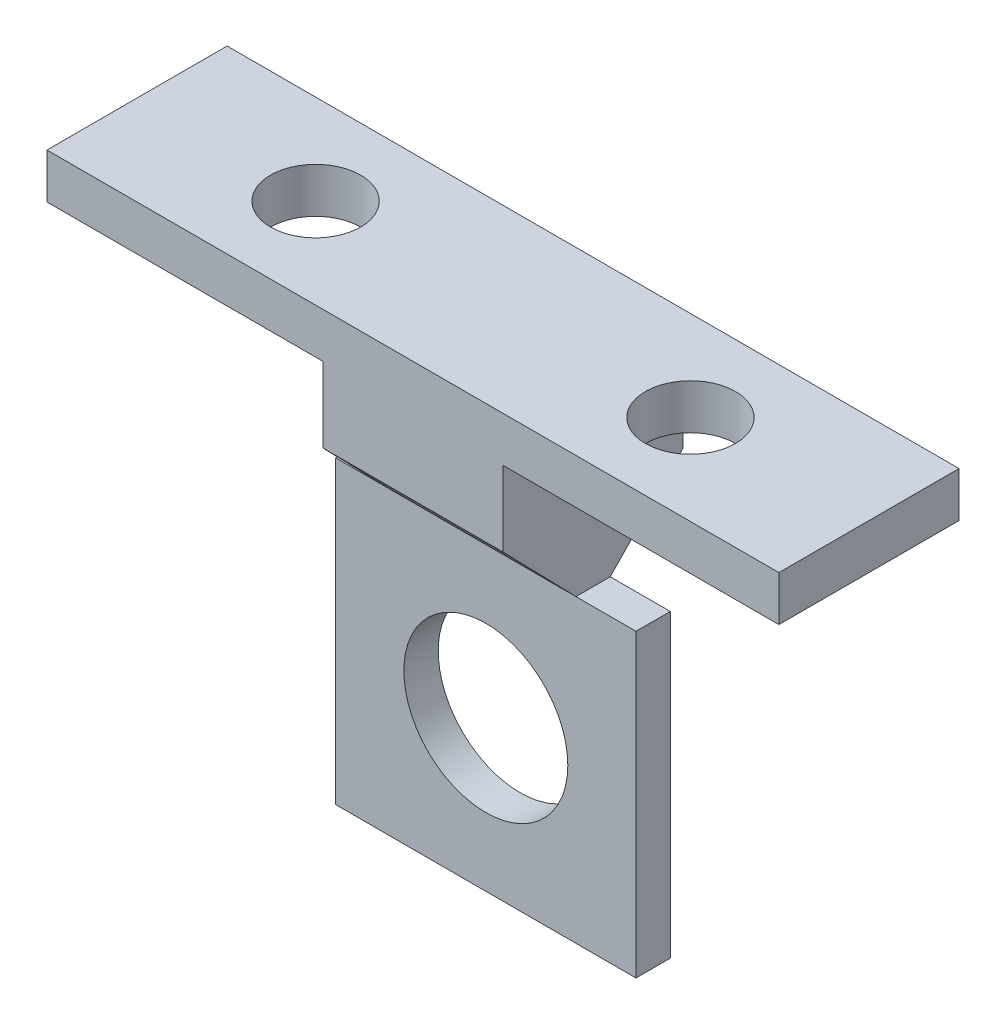
ISO-10303-21;
HEADER;
FILE_DESCRIPTION(('STEP AP214'),'2;1');
FILE_NAME('part.step','',(''),(''),'','','');
FILE_SCHEMA(('AUTOMOTIVE_DESIGN { 1 0 10303 214 1 1 1 1 }'));
ENDSEC;
DATA;
#1=APPLICATION_CONTEXT('core data for automotive mechanical design processes');
#2=APPLICATION_PROTOCOL_DEFINITION('international standard','automotive_design',2000,#1);
#3=PRODUCT_CONTEXT('',#1,'mechanical');
#4=PRODUCT('Part','Part','',(#3));
#5=PRODUCT_RELATED_PRODUCT_CATEGORY('part','',(#4));
#6=PRODUCT_DEFINITION_FORMATION('','',#4);
#7=PRODUCT_DEFINITION_CONTEXT('part definition',#1,'design');
#8=PRODUCT_DEFINITION('design','',#6,#7);
#9=PRODUCT_DEFINITION_SHAPE('','',#8);
#10=(LENGTH_UNIT() NAMED_UNIT(*) SI_UNIT(.MILLI.,.METRE.));
#11=(NAMED_UNIT(*) PLANE_ANGLE_UNIT() SI_UNIT($,.RADIAN.));
#12=(NAMED_UNIT(*) SI_UNIT($,.STERADIAN.) SOLID_ANGLE_UNIT());
#13=UNCERTAINTY_MEASURE_WITH_UNIT(LENGTH_MEASURE(1.E-05),#10,'distance_accuracy_value','');
#14=(GEOMETRIC_REPRESENTATION_CONTEXT(3) GLOBAL_UNCERTAINTY_ASSIGNED_CONTEXT((#13)) GLOBAL_UNIT_ASSIGNED_CONTEXT((#10,
#11,#12)) REPRESENTATION_CONTEXT('',''));
#15=CARTESIAN_POINT('',(0.,0.,0.));
#16=DIRECTION('',(0.,0.,1.));
#17=DIRECTION('',(1.,0.,0.));
#18=AXIS2_PLACEMENT_3D('',#15,#16,#17);
#19=CARTESIAN_POINT('',(-33.0408964823714,13.4768329024308,2.286));
#20=DIRECTION('',(0.,1.,0.));
#21=DIRECTION('',(0.,0.,1.));
#22=AXIS2_PLACEMENT_3D('',#19,#20,#21);
#23=PLANE('',#22);
#24=CARTESIAN_POINT('',(-26.5580724223715,13.4768329024308,1.143));
#25=DIRECTION('',(0.,1.,0.));
#26=DIRECTION('',(0.,0.,1.));
#27=AXIS2_PLACEMENT_3D('',#24,#25,#26);
#28=CIRCLE('',#27,2.99999999999999);
#29=CARTESIAN_POINT('',(-26.5580724223715,13.4768329024308,4.14299999999999));
#30=VERTEX_POINT('',#29);
#31=EDGE_CURVE('E302',#30,#30,#28,.F.);
#32=ORIENTED_EDGE('',*,*,#31,.F.);
#33=EDGE_LOOP('',(#32));
#34=FACE_BOUND('',#33,.T.);
#35=DIRECTION('',(0.,0.,-1.));
#36=VECTOR('',#35,1.);
#37=CARTESIAN_POINT('',(-33.0408964823714,13.4768329024308,2.286));
#38=LINE('',#37,#36);
#39=CARTESIAN_POINT('',(-33.0408964823714,13.4768329024311,7.143));
#40=VERTEX_POINT('',#39);
#41=CARTESIAN_POINT('',(-33.0408964823714,13.4768329024311,-4.857));
#42=VERTEX_POINT('',#41);
#43=EDGE_CURVE('E60',#40,#42,#38,.T.);
#44=ORIENTED_EDGE('',*,*,#43,.T.);
#45=DIRECTION('',(-1.,0.,0.));
#46=VECTOR('',#45,1.);
#47=CARTESIAN_POINT('',(-2.29721093551843,13.4768329024311,-4.857));
#48=LINE('',#47,#46);
#49=CARTESIAN_POINT('',(-14.6665278123714,13.4768329024311,-4.857));
#50=VERTEX_POINT('',#49);
#51=EDGE_CURVE('E202',#50,#42,#48,.T.);
#52=ORIENTED_EDGE('',*,*,#51,.F.);
#53=DIRECTION('',(0.,0.,-1.));
#54=VECTOR('',#53,1.);
#55=CARTESIAN_POINT('',(-14.6665278123714,13.4768329024308,2.286));
#56=LINE('',#55,#54);
#57=CARTESIAN_POINT('',(-14.6665278123714,13.4768329024311,7.143));
#58=VERTEX_POINT('',#57);
#59=EDGE_CURVE('E229',#58,#50,#56,.T.);
#60=ORIENTED_EDGE('',*,*,#59,.F.);
#61=DIRECTION('',(-1.,0.,0.));
#62=VECTOR('',#61,1.);
#63=CARTESIAN_POINT('',(-2.29721093551843,13.4768329024311,7.143));
#64=LINE('',#63,#62);
#65=EDGE_CURVE('E199',#58,#40,#64,.T.);
#66=ORIENTED_EDGE('',*,*,#65,.T.);
#67=EDGE_LOOP('',(#44,#52,#60,#66));
#68=FACE_BOUND('',#67,.T.);
#69=ADVANCED_FACE('F37',(#34,#68),#23,.F.);
#70=CARTESIAN_POINT('',(-51.5237205423715,13.4768329024308,1.143));
#71=DIRECTION('',(0.,1.,0.));
#72=DIRECTION('',(0.,0.,1.));
#73=AXIS2_PLACEMENT_3D('',#70,#71,#72);
#74=CIRCLE('',#73,3.);
#75=CARTESIAN_POINT('',(-51.5237205423715,13.4768329024308,4.143));
#76=VERTEX_POINT('',#75);
#77=EDGE_CURVE('E307',#76,#76,#74,.F.);
#78=ORIENTED_EDGE('',*,*,#77,.F.);
#79=EDGE_LOOP('',(#78));
#80=FACE_BOUND('',#79,.T.);
#81=DIRECTION('',(0.,0.,-1.));
#82=VECTOR('',#81,1.);
#83=CARTESIAN_POINT('',(-45.0408964823714,13.4768329024308,2.286));
#84=LINE('',#83,#82);
#85=CARTESIAN_POINT('',(-45.0408964823714,13.4768329024311,7.143));
#86=VERTEX_POINT('',#85);
#87=CARTESIAN_POINT('',(-45.0408964823714,13.4768329024311,-4.857));
#88=VERTEX_POINT('',#87);
#89=EDGE_CURVE('E46',#86,#88,#84,.T.);
#90=ORIENTED_EDGE('',*,*,#89,.F.);
#91=CARTESIAN_POINT('',(-63.4152651523715,13.4768329024311,7.143));
#92=VERTEX_POINT('',#91);
#93=EDGE_CURVE('E201',#86,#92,#64,.T.);
#94=ORIENTED_EDGE('',*,*,#93,.T.);
#95=DIRECTION('',(0.,0.,-1.));
#96=VECTOR('',#95,1.);
#97=CARTESIAN_POINT('',(-63.4152651523715,13.4768329024308,2.286));
#98=LINE('',#97,#96);
#99=CARTESIAN_POINT('',(-63.4152651523715,13.4768329024311,-4.857));
#100=VERTEX_POINT('',#99);
#101=EDGE_CURVE('E11',#92,#100,#98,.T.);
#102=ORIENTED_EDGE('',*,*,#101,.T.);
#103=EDGE_CURVE('E193',#88,#100,#48,.T.);
#104=ORIENTED_EDGE('',*,*,#103,.F.);
#105=EDGE_LOOP('',(#90,#94,#102,#104));
#106=FACE_BOUND('',#105,.T.);
#107=ADVANCED_FACE('F338',(#80,#106),#23,.F.);
#108=CARTESIAN_POINT('',(-63.4152651523714,16.4768329024308,2.286));
#109=DIRECTION('',(1.,0.,0.));
#110=DIRECTION('',(0.,1.,0.));
#111=AXIS2_PLACEMENT_3D('',#108,#109,#110);
#112=PLANE('',#111);
#113=DIRECTION('',(0.,0.,-1.));
#114=VECTOR('',#113,1.);
#115=CARTESIAN_POINT('',(-63.4152651523714,16.4768329024308,2.286));
#116=LINE('',#115,#114);
#117=CARTESIAN_POINT('',(-63.4152651523715,16.4768329024311,7.143));
#118=VERTEX_POINT('',#117);
#119=CARTESIAN_POINT('',(-63.4152651523715,16.4768329024311,-4.857));
#120=VERTEX_POINT('',#119);
#121=EDGE_CURVE('E216',#118,#120,#116,.T.);
#122=ORIENTED_EDGE('',*,*,#121,.T.);
#123=DIRECTION('',(0.,-1.,0.));
#124=VECTOR('',#123,1.);
#125=CARTESIAN_POINT('',(-63.4152651523715,16.4768329024311,-4.857));
#126=LINE('',#125,#124);
#127=EDGE_CURVE('E179',#120,#100,#126,.T.);
#128=ORIENTED_EDGE('',*,*,#127,.T.);
#129=ORIENTED_EDGE('',*,*,#101,.F.);
#130=DIRECTION('',(0.,1.,0.));
#131=VECTOR('',#130,1.);
#132=CARTESIAN_POINT('',(-63.4152651523715,16.4768329024311,7.143));
#133=LINE('',#132,#131);
#134=EDGE_CURVE('E190',#92,#118,#133,.T.);
#135=ORIENTED_EDGE('',*,*,#134,.T.);
#136=EDGE_LOOP('',(#122,#128,#129,#135));
#137=FACE_BOUND('',#136,.T.);
#138=ADVANCED_FACE('F39',(#137),#112,.F.);
#139=CARTESIAN_POINT('',(-45.0408964823714,8.47683290243078,2.286));
#140=DIRECTION('',(1.,0.,0.));
#141=DIRECTION('',(0.,0.,-1.));
#142=AXIS2_PLACEMENT_3D('',#139,#140,#141);
#143=PLANE('',#142);
#144=ORIENTED_EDGE('',*,*,#89,.T.);
#145=DIRECTION('',(0.,-1.,0.));
#146=VECTOR('',#145,1.);
#147=CARTESIAN_POINT('',(-45.0408964823714,13.4768329024311,-4.857));
#148=LINE('',#147,#146);
#149=CARTESIAN_POINT('',(-45.0408964823714,8.47683290243107,-4.857));
#150=VERTEX_POINT('',#149);
#151=EDGE_CURVE('E165',#88,#150,#148,.T.);
#152=ORIENTED_EDGE('',*,*,#151,.T.);
#153=DIRECTION('',(0.,-0.71728962347272,0.696775140241358));
#154=VECTOR('',#153,1.);
#155=CARTESIAN_POINT('',(-45.0408964823714,8.47683290243107,-4.857));
#156=LINE('',#155,#154);
#157=CARTESIAN_POINT('',(-45.0408964823714,3.47683290243076,0.));
#158=VERTEX_POINT('',#157);
#159=EDGE_CURVE('E297',#150,#158,#156,.T.);
#160=ORIENTED_EDGE('',*,*,#159,.T.);
#161=DIRECTION('',(0.,0.,-1.));
#162=VECTOR('',#161,1.);
#163=CARTESIAN_POINT('',(-45.0408964823714,3.47683290243078,2.286));
#164=LINE('',#163,#162);
#165=CARTESIAN_POINT('',(-45.0408964823714,3.47683290243078,2.286));
#166=VERTEX_POINT('',#165);
#167=EDGE_CURVE('E246',#166,#158,#164,.T.);
#168=ORIENTED_EDGE('',*,*,#167,.F.);
#169=DIRECTION('',(0.,0.71728962347272,0.696775140241358));
#170=VECTOR('',#169,1.);
#171=CARTESIAN_POINT('',(-45.0408964823714,3.47683290243076,2.286));
#172=LINE('',#171,#170);
#173=CARTESIAN_POINT('',(-45.0408964823714,8.47683290243107,7.143));
#174=VERTEX_POINT('',#173);
#175=EDGE_CURVE('E173',#166,#174,#172,.T.);
#176=ORIENTED_EDGE('',*,*,#175,.T.);
#177=DIRECTION('',(0.,1.,0.));
#178=VECTOR('',#177,1.);
#179=CARTESIAN_POINT('',(-45.0408964823714,8.47683290243107,7.143));
#180=LINE('',#179,#178);
#181=EDGE_CURVE('E147',#174,#86,#180,.T.);
#182=ORIENTED_EDGE('',*,*,#181,.T.);
#183=EDGE_LOOP('',(#144,#152,#160,#168,#176,#182));
#184=FACE_BOUND('',#183,.T.);
#185=ADVANCED_FACE('F296',(#184),#143,.F.);
#186=CARTESIAN_POINT('',(-45.0408964823714,3.47683290243078,2.286));
#187=DIRECTION('',(0.,-1.,0.));
#188=DIRECTION('',(1.,0.,0.));
#189=AXIS2_PLACEMENT_3D('',#186,#187,#188);
#190=PLANE('',#189);
#191=DIRECTION('',(-1.,0.,0.));
#192=VECTOR('',#191,1.);
#193=CARTESIAN_POINT('',(-45.0408964823714,3.47683290243078,0.));
#194=LINE('',#193,#192);
#195=CARTESIAN_POINT('',(-49.0408964823714,3.47683290243077,0.));
#196=VERTEX_POINT('',#195);
#197=EDGE_CURVE('E187',#158,#196,#194,.T.);
#198=ORIENTED_EDGE('',*,*,#197,.T.);
#199=DIRECTION('',(0.,0.,-1.));
#200=VECTOR('',#199,1.);
#201=CARTESIAN_POINT('',(-49.0408964823714,3.47683290243077,2.286));
#202=LINE('',#201,#200);
#203=CARTESIAN_POINT('',(-49.0408964823714,3.47683290243077,2.286));
#204=VERTEX_POINT('',#203);
#205=EDGE_CURVE('E243',#204,#196,#202,.T.);
#206=ORIENTED_EDGE('',*,*,#205,.F.);
#207=DIRECTION('',(-1.,0.,0.));
#208=VECTOR('',#207,1.);
#209=CARTESIAN_POINT('',(-45.0408964823714,3.47683290243078,2.286));
#210=LINE('',#209,#208);
#211=EDGE_CURVE('E205',#166,#204,#210,.T.);
#212=ORIENTED_EDGE('',*,*,#211,.F.);
#213=ORIENTED_EDGE('',*,*,#167,.T.);
#214=EDGE_LOOP('',(#198,#206,#212,#213));
#215=FACE_BOUND('',#214,.T.);
#216=ADVANCED_FACE('F253',(#215),#190,.F.);
#217=CARTESIAN_POINT('',(-49.0408964823714,3.47683290243077,2.286));
#218=DIRECTION('',(1.,0.,0.));
#219=DIRECTION('',(0.,1.,0.));
#220=AXIS2_PLACEMENT_3D('',#217,#218,#219);
#221=PLANE('',#220);
#222=DIRECTION('',(0.,-1.,0.));
#223=VECTOR('',#222,1.);
#224=CARTESIAN_POINT('',(-49.0408964823714,3.47683290243077,0.));
#225=LINE('',#224,#223);
#226=CARTESIAN_POINT('',(-49.0408964823714,-16.5231670975692,0.));
#227=VERTEX_POINT('',#226);
#228=EDGE_CURVE('E218',#196,#227,#225,.T.);
#229=ORIENTED_EDGE('',*,*,#228,.T.);
#230=DIRECTION('',(0.,0.,-1.));
#231=VECTOR('',#230,1.);
#232=CARTESIAN_POINT('',(-49.0408964823714,-16.5231670975692,2.286));
#233=LINE('',#232,#231);
#234=CARTESIAN_POINT('',(-49.0408964823714,-16.5231670975692,2.286));
#235=VERTEX_POINT('',#234);
#236=EDGE_CURVE('E240',#235,#227,#233,.T.);
#237=ORIENTED_EDGE('',*,*,#236,.F.);
#238=DIRECTION('',(0.,-1.,0.));
#239=VECTOR('',#238,1.);
#240=CARTESIAN_POINT('',(-49.0408964823714,3.47683290243077,2.286));
#241=LINE('',#240,#239);
#242=EDGE_CURVE('E207',#204,#235,#241,.T.);
#243=ORIENTED_EDGE('',*,*,#242,.F.);
#244=ORIENTED_EDGE('',*,*,#205,.T.);
#245=EDGE_LOOP('',(#229,#237,#243,#244));
#246=FACE_BOUND('',#245,.T.);
#247=ADVANCED_FACE('F264',(#246),#221,.F.);
#248=CARTESIAN_POINT('',(-49.0408964823714,-16.5231670975692,2.286));
#249=DIRECTION('',(0.,1.,0.));
#250=DIRECTION('',(-1.,0.,0.));
#251=AXIS2_PLACEMENT_3D('',#248,#249,#250);
#252=PLANE('',#251);
#253=DIRECTION('',(1.,0.,0.));
#254=VECTOR('',#253,1.);
#255=CARTESIAN_POINT('',(-49.0408964823714,-16.5231670975692,0.));
#256=LINE('',#255,#254);
#257=CARTESIAN_POINT('',(-29.0408964823714,-16.5231670975692,0.));
#258=VERTEX_POINT('',#257);
#259=EDGE_CURVE('E220',#227,#258,#256,.T.);
#260=ORIENTED_EDGE('',*,*,#259,.T.);
#261=DIRECTION('',(0.,0.,-1.));
#262=VECTOR('',#261,1.);
#263=CARTESIAN_POINT('',(-29.0408964823714,-16.5231670975692,2.286));
#264=LINE('',#263,#262);
#265=CARTESIAN_POINT('',(-29.0408964823714,-16.5231670975692,2.286));
#266=VERTEX_POINT('',#265);
#267=EDGE_CURVE('E237',#266,#258,#264,.T.);
#268=ORIENTED_EDGE('',*,*,#267,.F.);
#269=DIRECTION('',(1.,0.,0.));
#270=VECTOR('',#269,1.);
#271=CARTESIAN_POINT('',(-49.0408964823714,-16.5231670975692,2.286));
#272=LINE('',#271,#270);
#273=EDGE_CURVE('E210',#235,#266,#272,.T.);
#274=ORIENTED_EDGE('',*,*,#273,.F.);
#275=ORIENTED_EDGE('',*,*,#236,.T.);
#276=EDGE_LOOP('',(#260,#268,#274,#275));
#277=FACE_BOUND('',#276,.T.);
#278=ADVANCED_FACE('F268',(#277),#252,.F.);
#279=CARTESIAN_POINT('',(-29.0408964823714,3.47683290243078,2.286));
#280=DIRECTION('',(-1.,0.,0.));
#281=DIRECTION('',(0.,0.,1.));
#282=AXIS2_PLACEMENT_3D('',#279,#280,#281);
#283=PLANE('',#282);
#284=DIRECTION('',(0.,1.,0.));
#285=VECTOR('',#284,1.);
#286=CARTESIAN_POINT('',(-29.0408964823714,3.47683290243078,0.));
#287=LINE('',#286,#285);
#288=CARTESIAN_POINT('',(-29.0408964823714,3.47683290243078,0.));
#289=VERTEX_POINT('',#288);
#290=EDGE_CURVE('E222',#258,#289,#287,.T.);
#291=ORIENTED_EDGE('',*,*,#290,.T.);
#292=DIRECTION('',(0.,0.,-1.));
#293=VECTOR('',#292,1.);
#294=CARTESIAN_POINT('',(-29.0408964823714,3.47683290243078,2.286));
#295=LINE('',#294,#293);
#296=CARTESIAN_POINT('',(-29.0408964823714,3.47683290243078,2.286));
#297=VERTEX_POINT('',#296);
#298=EDGE_CURVE('E234',#297,#289,#295,.T.);
#299=ORIENTED_EDGE('',*,*,#298,.F.);
#300=DIRECTION('',(0.,1.,0.));
#301=VECTOR('',#300,1.);
#302=CARTESIAN_POINT('',(-29.0408964823714,3.47683290243078,2.286));
#303=LINE('',#302,#301);
#304=EDGE_CURVE('E212',#266,#297,#303,.T.);
#305=ORIENTED_EDGE('',*,*,#304,.F.);
#306=ORIENTED_EDGE('',*,*,#267,.T.);
#307=EDGE_LOOP('',(#291,#299,#305,#306));
#308=FACE_BOUND('',#307,.T.);
#309=ADVANCED_FACE('F352',(#308),#283,.F.);
#310=CARTESIAN_POINT('',(-29.0408964823714,3.47683290243078,2.286));
#311=DIRECTION('',(0.,-1.,0.));
#312=DIRECTION('',(1.,0.,0.));
#313=AXIS2_PLACEMENT_3D('',#310,#311,#312);
#314=PLANE('',#313);
#315=DIRECTION('',(-1.,0.,0.));
#316=VECTOR('',#315,1.);
#317=CARTESIAN_POINT('',(-29.0408964823714,3.47683290243078,0.));
#318=LINE('',#317,#316);
#319=CARTESIAN_POINT('',(-33.0408964823714,3.47683290243076,0.));
#320=VERTEX_POINT('',#319);
#321=EDGE_CURVE('E208',#289,#320,#318,.T.);
#322=ORIENTED_EDGE('',*,*,#321,.T.);
#323=DIRECTION('',(0.,0.,-1.));
#324=VECTOR('',#323,1.);
#325=CARTESIAN_POINT('',(-33.0408964823714,3.47683290243078,2.286));
#326=LINE('',#325,#324);
#327=CARTESIAN_POINT('',(-33.0408964823714,3.47683290243078,2.286));
#328=VERTEX_POINT('',#327);
#329=EDGE_CURVE('E232',#328,#320,#326,.T.);
#330=ORIENTED_EDGE('',*,*,#329,.F.);
#331=DIRECTION('',(-1.,0.,0.));
#332=VECTOR('',#331,1.);
#333=CARTESIAN_POINT('',(-29.0408964823714,3.47683290243078,2.286));
#334=LINE('',#333,#332);
#335=EDGE_CURVE('E214',#297,#328,#334,.T.);
#336=ORIENTED_EDGE('',*,*,#335,.F.);
#337=ORIENTED_EDGE('',*,*,#298,.T.);
#338=EDGE_LOOP('',(#322,#330,#336,#337));
#339=FACE_BOUND('',#338,.T.);
#340=ADVANCED_FACE('F277',(#339),#314,.F.);
#341=CARTESIAN_POINT('',(-33.0408964823714,13.4768329024308,2.286));
#342=DIRECTION('',(-1.,0.,0.));
#343=DIRECTION('',(0.,0.,1.));
#344=AXIS2_PLACEMENT_3D('',#341,#342,#343);
#345=PLANE('',#344);
#346=ORIENTED_EDGE('',*,*,#329,.T.);
#347=DIRECTION('',(0.,0.71728962347272,-0.696775140241358));
#348=VECTOR('',#347,1.);
#349=CARTESIAN_POINT('',(-33.0408964823714,8.47683290243107,-4.857));
#350=LINE('',#349,#348);
#351=CARTESIAN_POINT('',(-33.0408964823714,8.47683290243107,-4.857));
#352=VERTEX_POINT('',#351);
#353=EDGE_CURVE('E158',#320,#352,#350,.T.);
#354=ORIENTED_EDGE('',*,*,#353,.T.);
#355=DIRECTION('',(0.,1.,0.));
#356=VECTOR('',#355,1.);
#357=CARTESIAN_POINT('',(-33.0408964823714,13.4768329024311,-4.857));
#358=LINE('',#357,#356);
#359=EDGE_CURVE('E151',#352,#42,#358,.T.);
#360=ORIENTED_EDGE('',*,*,#359,.T.);
#361=ORIENTED_EDGE('',*,*,#43,.F.);
#362=DIRECTION('',(0.,-1.,0.));
#363=VECTOR('',#362,1.);
#364=CARTESIAN_POINT('',(-33.0408964823714,8.47683290243107,7.143));
#365=LINE('',#364,#363);
#366=CARTESIAN_POINT('',(-33.0408964823714,8.47683290243107,7.143));
#367=VERTEX_POINT('',#366);
#368=EDGE_CURVE('E145',#40,#367,#365,.T.);
#369=ORIENTED_EDGE('',*,*,#368,.T.);
#370=DIRECTION('',(0.,-0.71728962347272,-0.696775140241358));
#371=VECTOR('',#370,1.);
#372=CARTESIAN_POINT('',(-33.0408964823714,3.47683290243076,2.286));
#373=LINE('',#372,#371);
#374=EDGE_CURVE('E155',#367,#328,#373,.T.);
#375=ORIENTED_EDGE('',*,*,#374,.T.);
#376=EDGE_LOOP('',(#346,#354,#360,#361,#369,#375));
#377=FACE_BOUND('',#376,.T.);
#378=ADVANCED_FACE('F160',(#377),#345,.F.);
#379=CARTESIAN_POINT('',(-14.6665278123714,16.4768329024308,2.286));
#380=DIRECTION('',(-1.,0.,0.));
#381=DIRECTION('',(0.,-1.,0.));
#382=AXIS2_PLACEMENT_3D('',#379,#380,#381);
#383=PLANE('',#382);
#384=ORIENTED_EDGE('',*,*,#59,.T.);
#385=DIRECTION('',(0.,1.,0.));
#386=VECTOR('',#385,1.);
#387=CARTESIAN_POINT('',(-14.6665278123714,16.476832902431,-4.857));
#388=LINE('',#387,#386);
#389=CARTESIAN_POINT('',(-14.6665278123714,16.4768329024311,-4.857));
#390=VERTEX_POINT('',#389);
#391=EDGE_CURVE('E183',#50,#390,#388,.T.);
#392=ORIENTED_EDGE('',*,*,#391,.T.);
#393=DIRECTION('',(0.,0.,-1.));
#394=VECTOR('',#393,1.);
#395=CARTESIAN_POINT('',(-14.6665278123714,16.4768329024308,2.286));
#396=LINE('',#395,#394);
#397=CARTESIAN_POINT('',(-14.6665278123714,16.4768329024311,7.143));
#398=VERTEX_POINT('',#397);
#399=EDGE_CURVE('E227',#398,#390,#396,.T.);
#400=ORIENTED_EDGE('',*,*,#399,.F.);
#401=DIRECTION('',(0.,-1.,0.));
#402=VECTOR('',#401,1.);
#403=CARTESIAN_POINT('',(-14.6665278123714,16.476832902431,7.143));
#404=LINE('',#403,#402);
#405=EDGE_CURVE('E180',#398,#58,#404,.T.);
#406=ORIENTED_EDGE('',*,*,#405,.T.);
#407=EDGE_LOOP('',(#384,#392,#400,#406));
#408=FACE_BOUND('',#407,.T.);
#409=ADVANCED_FACE('F319',(#408),#383,.F.);
#410=CARTESIAN_POINT('',(-14.6665278123714,16.4768329024308,2.286));
#411=DIRECTION('',(0.,-1.,0.));
#412=DIRECTION('',(0.,0.,-1.));
#413=AXIS2_PLACEMENT_3D('',#410,#411,#412);
#414=PLANE('',#413);
#415=CARTESIAN_POINT('',(-26.5580724223715,16.4768329024308,1.143));
#416=DIRECTION('',(0.,1.,0.));
#417=DIRECTION('',(0.,0.,1.));
#418=AXIS2_PLACEMENT_3D('',#415,#416,#417);
#419=CIRCLE('',#418,2.99999999999999);
#420=CARTESIAN_POINT('',(-26.5580724223715,16.4768329024308,4.14299999999999));
#421=VERTEX_POINT('',#420);
#422=EDGE_CURVE('E306',#421,#421,#419,.T.);
#423=ORIENTED_EDGE('',*,*,#422,.F.);
#424=EDGE_LOOP('',(#423));
#425=FACE_BOUND('',#424,.T.);
#426=CARTESIAN_POINT('',(-51.5237205423715,16.4768329024308,1.143));
#427=DIRECTION('',(0.,1.,0.));
#428=DIRECTION('',(0.,0.,1.));
#429=AXIS2_PLACEMENT_3D('',#426,#427,#428);
#430=CIRCLE('',#429,3.);
#431=CARTESIAN_POINT('',(-51.5237205423715,16.4768329024308,4.143));
#432=VERTEX_POINT('',#431);
#433=EDGE_CURVE('E303',#432,#432,#430,.T.);
#434=ORIENTED_EDGE('',*,*,#433,.F.);
#435=EDGE_LOOP('',(#434));
#436=FACE_BOUND('',#435,.T.);
#437=ORIENTED_EDGE('',*,*,#399,.T.);
#438=DIRECTION('',(-1.,0.,0.));
#439=VECTOR('',#438,1.);
#440=CARTESIAN_POINT('',(-2.29721093551843,16.4768329024311,-4.857));
#441=LINE('',#440,#439);
#442=EDGE_CURVE('E184',#390,#120,#441,.T.);
#443=ORIENTED_EDGE('',*,*,#442,.T.);
#444=ORIENTED_EDGE('',*,*,#121,.F.);
#445=DIRECTION('',(-1.,0.,0.));
#446=VECTOR('',#445,1.);
#447=CARTESIAN_POINT('',(-2.29721093551843,16.4768329024311,7.143));
#448=LINE('',#447,#446);
#449=EDGE_CURVE('E196',#398,#118,#448,.T.);
#450=ORIENTED_EDGE('',*,*,#449,.F.);
#451=EDGE_LOOP('',(#437,#443,#444,#450));
#452=FACE_BOUND('',#451,.T.);
#453=ADVANCED_FACE('F291',(#425,#436,#452),#414,.F.);
#454=CARTESIAN_POINT('',(0.,0.,2.286));
#455=DIRECTION('',(0.,0.,1.));
#456=DIRECTION('',(1.,0.,0.));
#457=AXIS2_PLACEMENT_3D('',#454,#455,#456);
#458=PLANE('',#457);
#459=CARTESIAN_POINT('',(-39.0408964823714,-6.52316709756922,2.286));
#460=DIRECTION('',(0.,0.,1.));
#461=DIRECTION('',(1.,0.,0.));
#462=AXIS2_PLACEMENT_3D('',#459,#460,#461);
#463=CIRCLE('',#462,5.46);
#464=CARTESIAN_POINT('',(-33.5808964823714,-6.52316709756922,2.286));
#465=VERTEX_POINT('',#464);
#466=EDGE_CURVE('E163',#465,#465,#463,.T.);
#467=ORIENTED_EDGE('',*,*,#466,.F.);
#468=EDGE_LOOP('',(#467));
#469=FACE_BOUND('',#468,.T.);
#470=DIRECTION('',(1.,0.,0.));
#471=VECTOR('',#470,1.);
#472=CARTESIAN_POINT('',(-60.6613958341849,3.47683290243076,2.286));
#473=LINE('',#472,#471);
#474=EDGE_CURVE('E150',#166,#328,#473,.T.);
#475=ORIENTED_EDGE('',*,*,#474,.F.);
#476=ORIENTED_EDGE('',*,*,#211,.T.);
#477=ORIENTED_EDGE('',*,*,#242,.T.);
#478=ORIENTED_EDGE('',*,*,#273,.T.);
#479=ORIENTED_EDGE('',*,*,#304,.T.);
#480=ORIENTED_EDGE('',*,*,#335,.T.);
#481=EDGE_LOOP('',(#475,#476,#477,#478,#479,#480));
#482=FACE_BOUND('',#481,.T.);
#483=ADVANCED_FACE('F272',(#469,#482),#458,.T.);
#484=CARTESIAN_POINT('',(0.,0.,0.));
#485=DIRECTION('',(0.,0.,1.));
#486=DIRECTION('',(1.,0.,0.));
#487=AXIS2_PLACEMENT_3D('',#484,#485,#486);
#488=PLANE('',#487);
#489=CARTESIAN_POINT('',(-39.0408964823714,-6.52316709756922,0.));
#490=DIRECTION('',(0.,0.,1.));
#491=DIRECTION('',(1.,0.,0.));
#492=AXIS2_PLACEMENT_3D('',#489,#490,#491);
#493=CIRCLE('',#492,5.46);
#494=CARTESIAN_POINT('',(-33.5808964823714,-6.52316709756922,0.));
#495=VERTEX_POINT('',#494);
#496=EDGE_CURVE('E41',#495,#495,#493,.T.);
#497=ORIENTED_EDGE('',*,*,#496,.T.);
#498=EDGE_LOOP('',(#497));
#499=FACE_BOUND('',#498,.T.);
#500=ORIENTED_EDGE('',*,*,#197,.F.);
#501=DIRECTION('',(1.,0.,0.));
#502=VECTOR('',#501,1.);
#503=CARTESIAN_POINT('',(-60.6613958341849,3.47683290243076,0.));
#504=LINE('',#503,#502);
#505=EDGE_CURVE('E174',#158,#320,#504,.T.);
#506=ORIENTED_EDGE('',*,*,#505,.T.);
#507=ORIENTED_EDGE('',*,*,#321,.F.);
#508=ORIENTED_EDGE('',*,*,#290,.F.);
#509=ORIENTED_EDGE('',*,*,#259,.F.);
#510=ORIENTED_EDGE('',*,*,#228,.F.);
#511=EDGE_LOOP('',(#500,#506,#507,#508,#509,#510));
#512=FACE_BOUND('',#511,.T.);
#513=ADVANCED_FACE('F257',(#499,#512),#488,.F.);
#514=CARTESIAN_POINT('',(-2.29721093551843,16.4768329024311,-4.857));
#515=DIRECTION('',(0.,0.,-1.));
#516=DIRECTION('',(-1.,0.,0.));
#517=AXIS2_PLACEMENT_3D('',#514,#515,#516);
#518=PLANE('',#517);
#519=ORIENTED_EDGE('',*,*,#391,.F.);
#520=ORIENTED_EDGE('',*,*,#51,.T.);
#521=ORIENTED_EDGE('',*,*,#359,.F.);
#522=DIRECTION('',(1.,0.,0.));
#523=VECTOR('',#522,1.);
#524=CARTESIAN_POINT('',(-60.6613958341849,8.47683290243107,-4.857));
#525=LINE('',#524,#523);
#526=EDGE_CURVE('E171',#150,#352,#525,.T.);
#527=ORIENTED_EDGE('',*,*,#526,.F.);
#528=ORIENTED_EDGE('',*,*,#151,.F.);
#529=ORIENTED_EDGE('',*,*,#103,.T.);
#530=ORIENTED_EDGE('',*,*,#127,.F.);
#531=ORIENTED_EDGE('',*,*,#442,.F.);
#532=EDGE_LOOP('',(#519,#520,#521,#527,#528,#529,#530,#531));
#533=FACE_BOUND('',#532,.T.);
#534=ADVANCED_FACE('F283',(#533),#518,.T.);
#535=CARTESIAN_POINT('',(-2.29721093551843,16.4768329024311,7.143));
#536=DIRECTION('',(0.,0.,1.));
#537=DIRECTION('',(1.,0.,0.));
#538=AXIS2_PLACEMENT_3D('',#535,#536,#537);
#539=PLANE('',#538);
#540=ORIENTED_EDGE('',*,*,#405,.F.);
#541=ORIENTED_EDGE('',*,*,#449,.T.);
#542=ORIENTED_EDGE('',*,*,#134,.F.);
#543=ORIENTED_EDGE('',*,*,#93,.F.);
#544=ORIENTED_EDGE('',*,*,#181,.F.);
#545=DIRECTION('',(1.,0.,0.));
#546=VECTOR('',#545,1.);
#547=CARTESIAN_POINT('',(-60.6613958341849,8.47683290243107,7.143));
#548=LINE('',#547,#546);
#549=EDGE_CURVE('E140',#174,#367,#548,.T.);
#550=ORIENTED_EDGE('',*,*,#549,.T.);
#551=ORIENTED_EDGE('',*,*,#368,.F.);
#552=ORIENTED_EDGE('',*,*,#65,.F.);
#553=EDGE_LOOP('',(#540,#541,#542,#543,#544,#550,#551,#552));
#554=FACE_BOUND('',#553,.T.);
#555=ADVANCED_FACE('F143',(#554),#539,.T.);
#556=CARTESIAN_POINT('',(-60.6613958341849,3.47683290243076,2.286));
#557=DIRECTION('',(0.,-0.696775140241358,0.71728962347272));
#558=DIRECTION('',(0.,-0.71728962347272,-0.696775140241358));
#559=AXIS2_PLACEMENT_3D('',#556,#557,#558);
#560=PLANE('',#559);
#561=ORIENTED_EDGE('',*,*,#175,.F.);
#562=ORIENTED_EDGE('',*,*,#474,.T.);
#563=ORIENTED_EDGE('',*,*,#374,.F.);
#564=ORIENTED_EDGE('',*,*,#549,.F.);
#565=EDGE_LOOP('',(#561,#562,#563,#564));
#566=FACE_BOUND('',#565,.T.);
#567=ADVANCED_FACE('F156',(#566),#560,.T.);
#568=CARTESIAN_POINT('',(-60.6613958341849,8.47683290243107,-4.857));
#569=DIRECTION('',(0.,-0.696775140241358,-0.71728962347272));
#570=DIRECTION('',(0.,0.71728962347272,-0.696775140241358));
#571=AXIS2_PLACEMENT_3D('',#568,#569,#570);
#572=PLANE('',#571);
#573=ORIENTED_EDGE('',*,*,#159,.F.);
#574=ORIENTED_EDGE('',*,*,#526,.T.);
#575=ORIENTED_EDGE('',*,*,#353,.F.);
#576=ORIENTED_EDGE('',*,*,#505,.F.);
#577=EDGE_LOOP('',(#573,#574,#575,#576));
#578=FACE_BOUND('',#577,.T.);
#579=ADVANCED_FACE('F334',(#578),#572,.T.);
#580=CARTESIAN_POINT('',(-39.0408964823714,-6.52316709756922,-4.857));
#581=DIRECTION('',(0.,0.,1.));
#582=DIRECTION('',(1.,0.,0.));
#583=AXIS2_PLACEMENT_3D('',#580,#581,#582);
#584=CYLINDRICAL_SURFACE('',#583,5.46);
#585=ORIENTED_EDGE('',*,*,#466,.T.);
#586=EDGE_LOOP('',(#585));
#587=FACE_BOUND('',#586,.T.);
#588=ORIENTED_EDGE('',*,*,#496,.F.);
#589=EDGE_LOOP('',(#588));
#590=FACE_BOUND('',#589,.T.);
#591=ADVANCED_FACE('F325',(#587,#590),#584,.F.);
#592=CARTESIAN_POINT('',(-51.5237205423715,4.9915515281922,1.143));
#593=DIRECTION('',(0.,1.,0.));
#594=DIRECTION('',(0.,0.,1.));
#595=AXIS2_PLACEMENT_3D('',#592,#593,#594);
#596=CYLINDRICAL_SURFACE('',#595,3.);
#597=ORIENTED_EDGE('',*,*,#77,.T.);
#598=EDGE_LOOP('',(#597));
#599=FACE_BOUND('',#598,.T.);
#600=ORIENTED_EDGE('',*,*,#433,.T.);
#601=EDGE_LOOP('',(#600));
#602=FACE_BOUND('',#601,.T.);
#603=ADVANCED_FACE('F323',(#599,#602),#596,.F.);
#604=CARTESIAN_POINT('',(-26.5580724223715,4.9915515281922,1.143));
#605=DIRECTION('',(0.,1.,0.));
#606=DIRECTION('',(0.,0.,1.));
#607=AXIS2_PLACEMENT_3D('',#604,#605,#606);
#608=CYLINDRICAL_SURFACE('',#607,2.99999999999999);
#609=ORIENTED_EDGE('',*,*,#31,.T.);
#610=EDGE_LOOP('',(#609));
#611=FACE_BOUND('',#610,.T.);
#612=ORIENTED_EDGE('',*,*,#422,.T.);
#613=EDGE_LOOP('',(#612));
#614=FACE_BOUND('',#613,.T.);
#615=ADVANCED_FACE('F315',(#611,#614),#608,.F.);
#616=CLOSED_SHELL('',(#69,#107,#138,#185,#216,#247,#278,#309,#340,#378,#409,#453,#483,#513,#534,
#555,#567,#579,#591,#603,#615));
#617=MANIFOLD_SOLID_BREP('B2',#616);
#618=ADVANCED_BREP_SHAPE_REPRESENTATION('',(#18,#617),#14);
#619=SHAPE_DEFINITION_REPRESENTATION(#9,#618);
ENDSEC;
END-ISO-10303-21;
